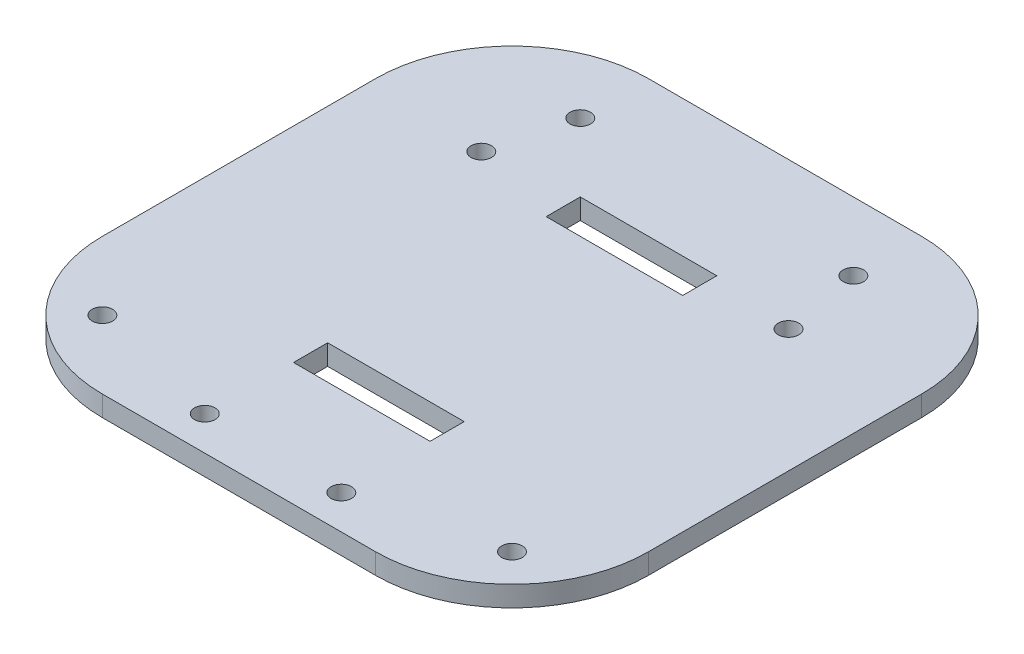
ISO-10303-21;
HEADER;
FILE_DESCRIPTION(('STEP AP214'),'2;1');
FILE_NAME('part.step','',(''),(''),'','','');
FILE_SCHEMA(('AUTOMOTIVE_DESIGN { 1 0 10303 214 1 1 1 1 }'));
ENDSEC;
DATA;
#1=APPLICATION_CONTEXT('core data for automotive mechanical design processes');
#2=APPLICATION_PROTOCOL_DEFINITION('international standard','automotive_design',2000,#1);
#3=PRODUCT_CONTEXT('',#1,'mechanical');
#4=PRODUCT('Part','Part','',(#3));
#5=PRODUCT_RELATED_PRODUCT_CATEGORY('part','',(#4));
#6=PRODUCT_DEFINITION_FORMATION('','',#4);
#7=PRODUCT_DEFINITION_CONTEXT('part definition',#1,'design');
#8=PRODUCT_DEFINITION('design','',#6,#7);
#9=PRODUCT_DEFINITION_SHAPE('','',#8);
#10=(LENGTH_UNIT() NAMED_UNIT(*) SI_UNIT(.MILLI.,.METRE.));
#11=(NAMED_UNIT(*) PLANE_ANGLE_UNIT() SI_UNIT($,.RADIAN.));
#12=(NAMED_UNIT(*) SI_UNIT($,.STERADIAN.) SOLID_ANGLE_UNIT());
#13=UNCERTAINTY_MEASURE_WITH_UNIT(LENGTH_MEASURE(1.E-05),#10,'distance_accuracy_value','');
#14=(GEOMETRIC_REPRESENTATION_CONTEXT(3) GLOBAL_UNCERTAINTY_ASSIGNED_CONTEXT((#13)) GLOBAL_UNIT_ASSIGNED_CONTEXT((#10,
#11,#12)) REPRESENTATION_CONTEXT('',''));
#15=CARTESIAN_POINT('',(0.,0.,0.));
#16=DIRECTION('',(0.,0.,1.));
#17=DIRECTION('',(1.,0.,0.));
#18=AXIS2_PLACEMENT_3D('',#15,#16,#17);
#19=CARTESIAN_POINT('',(20.,3.,-20.));
#20=DIRECTION('',(0.,-1.,0.));
#21=DIRECTION('',(0.,0.,-1.));
#22=AXIS2_PLACEMENT_3D('',#19,#20,#21);
#23=CYLINDRICAL_SURFACE('',#22,20.);
#24=DIRECTION('',(0.,-1.,0.));
#25=VECTOR('',#24,1.);
#26=CARTESIAN_POINT('',(20.,3.,0.));
#27=LINE('',#26,#25);
#28=CARTESIAN_POINT('',(20.,3.,0.));
#29=VERTEX_POINT('',#28);
#30=CARTESIAN_POINT('',(20.,0.,0.));
#31=VERTEX_POINT('',#30);
#32=EDGE_CURVE('E293',#29,#31,#27,.T.);
#33=ORIENTED_EDGE('',*,*,#32,.F.);
#34=CARTESIAN_POINT('',(20.,3.,-20.));
#35=DIRECTION('',(0.,-1.,0.));
#36=DIRECTION('',(0.,0.,-1.));
#37=AXIS2_PLACEMENT_3D('',#34,#35,#36);
#38=CIRCLE('',#37,20.);
#39=CARTESIAN_POINT('',(0.,3.,-20.));
#40=VERTEX_POINT('',#39);
#41=EDGE_CURVE('E299',#40,#29,#38,.F.);
#42=ORIENTED_EDGE('',*,*,#41,.F.);
#43=DIRECTION('',(0.,-1.,0.));
#44=VECTOR('',#43,1.);
#45=CARTESIAN_POINT('',(0.,3.,-20.));
#46=LINE('',#45,#44);
#47=CARTESIAN_POINT('',(0.,0.,-20.));
#48=VERTEX_POINT('',#47);
#49=EDGE_CURVE('E296',#48,#40,#46,.F.);
#50=ORIENTED_EDGE('',*,*,#49,.F.);
#51=CARTESIAN_POINT('',(20.,0.,-20.));
#52=DIRECTION('',(0.,-1.,0.));
#53=DIRECTION('',(0.,0.,-1.));
#54=AXIS2_PLACEMENT_3D('',#51,#52,#53);
#55=CIRCLE('',#54,20.);
#56=EDGE_CURVE('E301',#31,#48,#55,.T.);
#57=ORIENTED_EDGE('',*,*,#56,.F.);
#58=EDGE_LOOP('',(#33,#42,#50,#57));
#59=FACE_BOUND('',#58,.T.);
#60=ADVANCED_FACE('F35',(#59),#23,.T.);
#61=CARTESIAN_POINT('',(60.,3.,-20.));
#62=DIRECTION('',(0.,-1.,0.));
#63=DIRECTION('',(0.,0.,-1.));
#64=AXIS2_PLACEMENT_3D('',#61,#62,#63);
#65=CYLINDRICAL_SURFACE('',#64,20.);
#66=DIRECTION('',(0.,-1.,0.));
#67=VECTOR('',#66,1.);
#68=CARTESIAN_POINT('',(80.,3.,-20.));
#69=LINE('',#68,#67);
#70=CARTESIAN_POINT('',(80.,3.,-20.));
#71=VERTEX_POINT('',#70);
#72=CARTESIAN_POINT('',(80.,0.,-20.));
#73=VERTEX_POINT('',#72);
#74=EDGE_CURVE('E282',#71,#73,#69,.T.);
#75=ORIENTED_EDGE('',*,*,#74,.F.);
#76=CARTESIAN_POINT('',(60.,3.,-20.));
#77=DIRECTION('',(0.,-1.,0.));
#78=DIRECTION('',(0.,0.,-1.));
#79=AXIS2_PLACEMENT_3D('',#76,#77,#78);
#80=CIRCLE('',#79,20.);
#81=CARTESIAN_POINT('',(60.,3.,0.));
#82=VERTEX_POINT('',#81);
#83=EDGE_CURVE('E288',#82,#71,#80,.F.);
#84=ORIENTED_EDGE('',*,*,#83,.F.);
#85=DIRECTION('',(0.,-1.,0.));
#86=VECTOR('',#85,1.);
#87=CARTESIAN_POINT('',(60.,3.,0.));
#88=LINE('',#87,#86);
#89=CARTESIAN_POINT('',(60.,0.,0.));
#90=VERTEX_POINT('',#89);
#91=EDGE_CURVE('E285',#90,#82,#88,.F.);
#92=ORIENTED_EDGE('',*,*,#91,.F.);
#93=CARTESIAN_POINT('',(60.,0.,-20.));
#94=DIRECTION('',(0.,-1.,0.));
#95=DIRECTION('',(0.,0.,-1.));
#96=AXIS2_PLACEMENT_3D('',#93,#94,#95);
#97=CIRCLE('',#96,20.);
#98=EDGE_CURVE('E290',#73,#90,#97,.T.);
#99=ORIENTED_EDGE('',*,*,#98,.F.);
#100=EDGE_LOOP('',(#75,#84,#92,#99));
#101=FACE_BOUND('',#100,.T.);
#102=ADVANCED_FACE('F337',(#101),#65,.T.);
#103=CARTESIAN_POINT('',(60.,3.,-60.));
#104=DIRECTION('',(0.,1.,0.));
#105=DIRECTION('',(0.,0.,1.));
#106=AXIS2_PLACEMENT_3D('',#103,#104,#105);
#107=CYLINDRICAL_SURFACE('',#106,20.);
#108=DIRECTION('',(0.,1.,0.));
#109=VECTOR('',#108,1.);
#110=CARTESIAN_POINT('',(80.,3.,-60.));
#111=LINE('',#110,#109);
#112=CARTESIAN_POINT('',(80.,0.,-60.));
#113=VERTEX_POINT('',#112);
#114=CARTESIAN_POINT('',(80.,3.,-60.));
#115=VERTEX_POINT('',#114);
#116=EDGE_CURVE('E271',#113,#115,#111,.T.);
#117=ORIENTED_EDGE('',*,*,#116,.F.);
#118=CARTESIAN_POINT('',(60.,0.,-60.));
#119=DIRECTION('',(0.,-1.,0.));
#120=DIRECTION('',(0.,0.,-1.));
#121=AXIS2_PLACEMENT_3D('',#118,#119,#120);
#122=CIRCLE('',#121,20.);
#123=CARTESIAN_POINT('',(60.,0.,-80.));
#124=VERTEX_POINT('',#123);
#125=EDGE_CURVE('E277',#124,#113,#122,.T.);
#126=ORIENTED_EDGE('',*,*,#125,.F.);
#127=DIRECTION('',(0.,1.,0.));
#128=VECTOR('',#127,1.);
#129=CARTESIAN_POINT('',(60.,3.,-80.));
#130=LINE('',#129,#128);
#131=CARTESIAN_POINT('',(60.,3.,-80.));
#132=VERTEX_POINT('',#131);
#133=EDGE_CURVE('E274',#132,#124,#130,.F.);
#134=ORIENTED_EDGE('',*,*,#133,.F.);
#135=CARTESIAN_POINT('',(60.,3.,-60.));
#136=DIRECTION('',(0.,-1.,0.));
#137=DIRECTION('',(0.,0.,-1.));
#138=AXIS2_PLACEMENT_3D('',#135,#136,#137);
#139=CIRCLE('',#138,20.);
#140=EDGE_CURVE('E280',#115,#132,#139,.F.);
#141=ORIENTED_EDGE('',*,*,#140,.F.);
#142=EDGE_LOOP('',(#117,#126,#134,#141));
#143=FACE_BOUND('',#142,.T.);
#144=ADVANCED_FACE('F342',(#143),#107,.T.);
#145=CARTESIAN_POINT('',(20.,3.,-60.));
#146=DIRECTION('',(0.,-1.,0.));
#147=DIRECTION('',(0.,0.,-1.));
#148=AXIS2_PLACEMENT_3D('',#145,#146,#147);
#149=CYLINDRICAL_SURFACE('',#148,20.);
#150=DIRECTION('',(0.,-1.,0.));
#151=VECTOR('',#150,1.);
#152=CARTESIAN_POINT('',(0.,3.,-60.));
#153=LINE('',#152,#151);
#154=CARTESIAN_POINT('',(0.,3.,-60.));
#155=VERTEX_POINT('',#154);
#156=CARTESIAN_POINT('',(0.,0.,-60.));
#157=VERTEX_POINT('',#156);
#158=EDGE_CURVE('E253',#155,#157,#153,.T.);
#159=ORIENTED_EDGE('',*,*,#158,.F.);
#160=CARTESIAN_POINT('',(20.,3.,-60.));
#161=DIRECTION('',(0.,-1.,0.));
#162=DIRECTION('',(0.,0.,-1.));
#163=AXIS2_PLACEMENT_3D('',#160,#161,#162);
#164=CIRCLE('',#163,20.);
#165=CARTESIAN_POINT('',(20.,3.,-80.));
#166=VERTEX_POINT('',#165);
#167=EDGE_CURVE('E266',#166,#155,#164,.F.);
#168=ORIENTED_EDGE('',*,*,#167,.F.);
#169=DIRECTION('',(0.,-1.,0.));
#170=VECTOR('',#169,1.);
#171=CARTESIAN_POINT('',(20.,3.,-80.));
#172=LINE('',#171,#170);
#173=CARTESIAN_POINT('',(20.,0.,-80.));
#174=VERTEX_POINT('',#173);
#175=EDGE_CURVE('E263',#174,#166,#172,.F.);
#176=ORIENTED_EDGE('',*,*,#175,.F.);
#177=CARTESIAN_POINT('',(20.,0.,-60.));
#178=DIRECTION('',(0.,-1.,0.));
#179=DIRECTION('',(0.,0.,-1.));
#180=AXIS2_PLACEMENT_3D('',#177,#178,#179);
#181=CIRCLE('',#180,20.);
#182=EDGE_CURVE('E268',#157,#174,#181,.T.);
#183=ORIENTED_EDGE('',*,*,#182,.F.);
#184=EDGE_LOOP('',(#159,#168,#176,#183));
#185=FACE_BOUND('',#184,.T.);
#186=ADVANCED_FACE('F370',(#185),#149,.T.);
#187=CARTESIAN_POINT('',(0.,3.,0.));
#188=DIRECTION('',(1.,0.,0.));
#189=DIRECTION('',(0.,0.,-1.));
#190=AXIS2_PLACEMENT_3D('',#187,#188,#189);
#191=PLANE('',#190);
#192=DIRECTION('',(0.,0.,1.));
#193=VECTOR('',#192,1.);
#194=CARTESIAN_POINT('',(0.,0.,0.));
#195=LINE('',#194,#193);
#196=EDGE_CURVE('E240',#157,#48,#195,.T.);
#197=ORIENTED_EDGE('',*,*,#196,.T.);
#198=ORIENTED_EDGE('',*,*,#49,.T.);
#199=DIRECTION('',(0.,0.,1.));
#200=VECTOR('',#199,1.);
#201=CARTESIAN_POINT('',(0.,3.,0.));
#202=LINE('',#201,#200);
#203=EDGE_CURVE('E243',#155,#40,#202,.T.);
#204=ORIENTED_EDGE('',*,*,#203,.F.);
#205=ORIENTED_EDGE('',*,*,#158,.T.);
#206=EDGE_LOOP('',(#197,#198,#204,#205));
#207=FACE_BOUND('',#206,.T.);
#208=ADVANCED_FACE('F374',(#207),#191,.F.);
#209=CARTESIAN_POINT('',(0.,3.,0.));
#210=DIRECTION('',(0.,0.,-1.));
#211=DIRECTION('',(-1.,0.,0.));
#212=AXIS2_PLACEMENT_3D('',#209,#210,#211);
#213=PLANE('',#212);
#214=DIRECTION('',(1.,0.,0.));
#215=VECTOR('',#214,1.);
#216=CARTESIAN_POINT('',(0.,3.,0.));
#217=LINE('',#216,#215);
#218=EDGE_CURVE('E246',#29,#82,#217,.T.);
#219=ORIENTED_EDGE('',*,*,#218,.F.);
#220=ORIENTED_EDGE('',*,*,#32,.T.);
#221=DIRECTION('',(1.,0.,0.));
#222=VECTOR('',#221,1.);
#223=CARTESIAN_POINT('',(0.,0.,0.));
#224=LINE('',#223,#222);
#225=EDGE_CURVE('E256',#31,#90,#224,.T.);
#226=ORIENTED_EDGE('',*,*,#225,.T.);
#227=ORIENTED_EDGE('',*,*,#91,.T.);
#228=EDGE_LOOP('',(#219,#220,#226,#227));
#229=FACE_BOUND('',#228,.T.);
#230=ADVANCED_FACE('F349',(#229),#213,.F.);
#231=CARTESIAN_POINT('',(80.,3.,0.));
#232=DIRECTION('',(-1.,0.,0.));
#233=DIRECTION('',(0.,0.,1.));
#234=AXIS2_PLACEMENT_3D('',#231,#232,#233);
#235=PLANE('',#234);
#236=DIRECTION('',(0.,0.,-1.));
#237=VECTOR('',#236,1.);
#238=CARTESIAN_POINT('',(80.,3.,0.));
#239=LINE('',#238,#237);
#240=EDGE_CURVE('E249',#71,#115,#239,.T.);
#241=ORIENTED_EDGE('',*,*,#240,.F.);
#242=ORIENTED_EDGE('',*,*,#74,.T.);
#243=DIRECTION('',(0.,0.,-1.));
#244=VECTOR('',#243,1.);
#245=CARTESIAN_POINT('',(80.,0.,0.));
#246=LINE('',#245,#244);
#247=EDGE_CURVE('E258',#73,#113,#246,.T.);
#248=ORIENTED_EDGE('',*,*,#247,.T.);
#249=ORIENTED_EDGE('',*,*,#116,.T.);
#250=EDGE_LOOP('',(#241,#242,#248,#249));
#251=FACE_BOUND('',#250,.T.);
#252=ADVANCED_FACE('F357',(#251),#235,.F.);
#253=CARTESIAN_POINT('',(0.,3.,-80.));
#254=DIRECTION('',(0.,0.,1.));
#255=DIRECTION('',(1.,0.,0.));
#256=AXIS2_PLACEMENT_3D('',#253,#254,#255);
#257=PLANE('',#256);
#258=DIRECTION('',(-1.,0.,0.));
#259=VECTOR('',#258,1.);
#260=CARTESIAN_POINT('',(0.,3.,-80.));
#261=LINE('',#260,#259);
#262=EDGE_CURVE('E251',#132,#166,#261,.T.);
#263=ORIENTED_EDGE('',*,*,#262,.F.);
#264=ORIENTED_EDGE('',*,*,#133,.T.);
#265=DIRECTION('',(-1.,0.,0.));
#266=VECTOR('',#265,1.);
#267=CARTESIAN_POINT('',(0.,0.,-80.));
#268=LINE('',#267,#266);
#269=EDGE_CURVE('E247',#124,#174,#268,.T.);
#270=ORIENTED_EDGE('',*,*,#269,.T.);
#271=ORIENTED_EDGE('',*,*,#175,.T.);
#272=EDGE_LOOP('',(#263,#264,#270,#271));
#273=FACE_BOUND('',#272,.T.);
#274=ADVANCED_FACE('F365',(#273),#257,.F.);
#275=CARTESIAN_POINT('',(0.,3.,0.));
#276=DIRECTION('',(0.,-1.,0.));
#277=DIRECTION('',(0.,0.,-1.));
#278=AXIS2_PLACEMENT_3D('',#275,#276,#277);
#279=PLANE('',#278);
#280=DIRECTION('',(1.,0.,0.));
#281=VECTOR('',#280,1.);
#282=CARTESIAN_POINT('',(30.,3.,-18.));
#283=LINE('',#282,#281);
#284=CARTESIAN_POINT('',(30.,3.,-18.));
#285=VERTEX_POINT('',#284);
#286=CARTESIAN_POINT('',(50.,3.,-18.));
#287=VERTEX_POINT('',#286);
#288=EDGE_CURVE('E158',#285,#287,#283,.T.);
#289=ORIENTED_EDGE('',*,*,#288,.F.);
#290=DIRECTION('',(0.,0.,1.));
#291=VECTOR('',#290,1.);
#292=CARTESIAN_POINT('',(30.,3.,-23.));
#293=LINE('',#292,#291);
#294=CARTESIAN_POINT('',(30.,3.,-23.));
#295=VERTEX_POINT('',#294);
#296=EDGE_CURVE('E49',#295,#285,#293,.T.);
#297=ORIENTED_EDGE('',*,*,#296,.F.);
#298=DIRECTION('',(-1.,0.,0.));
#299=VECTOR('',#298,1.);
#300=CARTESIAN_POINT('',(30.,3.,-23.));
#301=LINE('',#300,#299);
#302=CARTESIAN_POINT('',(50.,3.,-23.));
#303=VERTEX_POINT('',#302);
#304=EDGE_CURVE('E165',#303,#295,#301,.T.);
#305=ORIENTED_EDGE('',*,*,#304,.F.);
#306=DIRECTION('',(0.,0.,-1.));
#307=VECTOR('',#306,1.);
#308=CARTESIAN_POINT('',(50.,3.,-23.));
#309=LINE('',#308,#307);
#310=EDGE_CURVE('E149',#287,#303,#309,.T.);
#311=ORIENTED_EDGE('',*,*,#310,.F.);
#312=EDGE_LOOP('',(#289,#297,#305,#311));
#313=FACE_BOUND('',#312,.T.);
#314=DIRECTION('',(1.,0.,0.));
#315=VECTOR('',#314,1.);
#316=CARTESIAN_POINT('',(30.,3.,-55.));
#317=LINE('',#316,#315);
#318=CARTESIAN_POINT('',(30.,3.,-55.));
#319=VERTEX_POINT('',#318);
#320=CARTESIAN_POINT('',(50.,3.,-55.));
#321=VERTEX_POINT('',#320);
#322=EDGE_CURVE('E176',#319,#321,#317,.T.);
#323=ORIENTED_EDGE('',*,*,#322,.F.);
#324=DIRECTION('',(0.,0.,1.));
#325=VECTOR('',#324,1.);
#326=CARTESIAN_POINT('',(30.,3.,-60.));
#327=LINE('',#326,#325);
#328=CARTESIAN_POINT('',(30.,3.,-60.));
#329=VERTEX_POINT('',#328);
#330=EDGE_CURVE('E172',#329,#319,#327,.T.);
#331=ORIENTED_EDGE('',*,*,#330,.F.);
#332=DIRECTION('',(-1.,0.,0.));
#333=VECTOR('',#332,1.);
#334=CARTESIAN_POINT('',(30.,3.,-60.));
#335=LINE('',#334,#333);
#336=CARTESIAN_POINT('',(50.,3.,-60.));
#337=VERTEX_POINT('',#336);
#338=EDGE_CURVE('E182',#337,#329,#335,.T.);
#339=ORIENTED_EDGE('',*,*,#338,.F.);
#340=DIRECTION('',(0.,0.,-1.));
#341=VECTOR('',#340,1.);
#342=CARTESIAN_POINT('',(50.,3.,-60.));
#343=LINE('',#342,#341);
#344=EDGE_CURVE('E179',#321,#337,#343,.T.);
#345=ORIENTED_EDGE('',*,*,#344,.F.);
#346=EDGE_LOOP('',(#323,#331,#339,#345));
#347=FACE_BOUND('',#346,.T.);
#348=CARTESIAN_POINT('',(60.,3.,-70.));
#349=DIRECTION('',(0.,1.,0.));
#350=DIRECTION('',(0.,0.,1.));
#351=AXIS2_PLACEMENT_3D('',#348,#349,#350);
#352=CIRCLE('',#351,1.5);
#353=CARTESIAN_POINT('',(60.,3.,-68.5));
#354=VERTEX_POINT('',#353);
#355=EDGE_CURVE('E188',#354,#354,#352,.T.);
#356=ORIENTED_EDGE('',*,*,#355,.F.);
#357=EDGE_LOOP('',(#356));
#358=FACE_BOUND('',#357,.T.);
#359=CARTESIAN_POINT('',(20.,3.,-70.));
#360=DIRECTION('',(0.,1.,0.));
#361=DIRECTION('',(0.,0.,1.));
#362=AXIS2_PLACEMENT_3D('',#359,#360,#361);
#363=CIRCLE('',#362,1.5);
#364=CARTESIAN_POINT('',(20.,3.,-68.5));
#365=VERTEX_POINT('',#364);
#366=EDGE_CURVE('E198',#365,#365,#363,.T.);
#367=ORIENTED_EDGE('',*,*,#366,.F.);
#368=EDGE_LOOP('',(#367));
#369=FACE_BOUND('',#368,.T.);
#370=CARTESIAN_POINT('',(50.,3.,-5.));
#371=DIRECTION('',(0.,1.,0.));
#372=DIRECTION('',(0.,0.,1.));
#373=AXIS2_PLACEMENT_3D('',#370,#371,#372);
#374=CIRCLE('',#373,1.5);
#375=CARTESIAN_POINT('',(50.,3.,-3.5));
#376=VERTEX_POINT('',#375);
#377=EDGE_CURVE('E204',#376,#376,#374,.T.);
#378=ORIENTED_EDGE('',*,*,#377,.F.);
#379=EDGE_LOOP('',(#378));
#380=FACE_BOUND('',#379,.T.);
#381=CARTESIAN_POINT('',(30.,3.,-5.));
#382=DIRECTION('',(0.,1.,0.));
#383=DIRECTION('',(0.,0.,1.));
#384=AXIS2_PLACEMENT_3D('',#381,#382,#383);
#385=CIRCLE('',#384,1.5);
#386=CARTESIAN_POINT('',(30.,3.,-3.49999999999999));
#387=VERTEX_POINT('',#386);
#388=EDGE_CURVE('E210',#387,#387,#385,.T.);
#389=ORIENTED_EDGE('',*,*,#388,.F.);
#390=EDGE_LOOP('',(#389));
#391=FACE_BOUND('',#390,.T.);
#392=CARTESIAN_POINT('',(10.,3.,-10.));
#393=DIRECTION('',(0.,1.,0.));
#394=DIRECTION('',(0.,0.,1.));
#395=AXIS2_PLACEMENT_3D('',#392,#393,#394);
#396=CIRCLE('',#395,1.5);
#397=CARTESIAN_POINT('',(10.,3.,-8.49999999999999));
#398=VERTEX_POINT('',#397);
#399=EDGE_CURVE('E216',#398,#398,#396,.T.);
#400=ORIENTED_EDGE('',*,*,#399,.F.);
#401=EDGE_LOOP('',(#400));
#402=FACE_BOUND('',#401,.T.);
#403=CARTESIAN_POINT('',(70.,3.,-9.99999999999999));
#404=DIRECTION('',(0.,1.,0.));
#405=DIRECTION('',(0.,0.,1.));
#406=AXIS2_PLACEMENT_3D('',#403,#404,#405);
#407=CIRCLE('',#406,1.5);
#408=CARTESIAN_POINT('',(70.,3.,-8.5));
#409=VERTEX_POINT('',#408);
#410=EDGE_CURVE('E222',#409,#409,#407,.T.);
#411=ORIENTED_EDGE('',*,*,#410,.F.);
#412=EDGE_LOOP('',(#411));
#413=FACE_BOUND('',#412,.T.);
#414=CARTESIAN_POINT('',(62.,3.,-58.5));
#415=DIRECTION('',(0.,1.,0.));
#416=DIRECTION('',(0.,0.,1.));
#417=AXIS2_PLACEMENT_3D('',#414,#415,#416);
#418=CIRCLE('',#417,1.5);
#419=CARTESIAN_POINT('',(62.,3.,-57.));
#420=VERTEX_POINT('',#419);
#421=EDGE_CURVE('E228',#420,#420,#418,.T.);
#422=ORIENTED_EDGE('',*,*,#421,.F.);
#423=EDGE_LOOP('',(#422));
#424=FACE_BOUND('',#423,.T.);
#425=CARTESIAN_POINT('',(17.,3.,-58.5));
#426=DIRECTION('',(0.,1.,0.));
#427=DIRECTION('',(0.,0.,1.));
#428=AXIS2_PLACEMENT_3D('',#425,#426,#427);
#429=CIRCLE('',#428,1.5);
#430=CARTESIAN_POINT('',(17.,3.,-57.));
#431=VERTEX_POINT('',#430);
#432=EDGE_CURVE('E234',#431,#431,#429,.T.);
#433=ORIENTED_EDGE('',*,*,#432,.F.);
#434=EDGE_LOOP('',(#433));
#435=FACE_BOUND('',#434,.T.);
#436=ORIENTED_EDGE('',*,*,#203,.T.);
#437=ORIENTED_EDGE('',*,*,#41,.T.);
#438=ORIENTED_EDGE('',*,*,#218,.T.);
#439=ORIENTED_EDGE('',*,*,#83,.T.);
#440=ORIENTED_EDGE('',*,*,#240,.T.);
#441=ORIENTED_EDGE('',*,*,#140,.T.);
#442=ORIENTED_EDGE('',*,*,#262,.T.);
#443=ORIENTED_EDGE('',*,*,#167,.T.);
#444=EDGE_LOOP('',(#436,#437,#438,#439,#440,#441,#442,#443));
#445=FACE_BOUND('',#444,.T.);
#446=ADVANCED_FACE('F162',(#313,#347,#358,#369,#380,#391,#402,#413,#424,#435,#445),#279,.F.);
#447=CARTESIAN_POINT('',(0.,0.,0.));
#448=DIRECTION('',(0.,-1.,0.));
#449=DIRECTION('',(0.,0.,-1.));
#450=AXIS2_PLACEMENT_3D('',#447,#448,#449);
#451=PLANE('',#450);
#452=DIRECTION('',(0.,0.,-1.));
#453=VECTOR('',#452,1.);
#454=CARTESIAN_POINT('',(30.,0.,0.));
#455=LINE('',#454,#453);
#456=CARTESIAN_POINT('',(30.,0.,-18.));
#457=VERTEX_POINT('',#456);
#458=CARTESIAN_POINT('',(30.,0.,-23.));
#459=VERTEX_POINT('',#458);
#460=EDGE_CURVE('E11',#457,#459,#455,.T.);
#461=ORIENTED_EDGE('',*,*,#460,.F.);
#462=DIRECTION('',(-1.,0.,0.));
#463=VECTOR('',#462,1.);
#464=CARTESIAN_POINT('',(0.,0.,-18.));
#465=LINE('',#464,#463);
#466=CARTESIAN_POINT('',(50.,0.,-18.));
#467=VERTEX_POINT('',#466);
#468=EDGE_CURVE('E312',#467,#457,#465,.T.);
#469=ORIENTED_EDGE('',*,*,#468,.F.);
#470=DIRECTION('',(0.,0.,1.));
#471=VECTOR('',#470,1.);
#472=CARTESIAN_POINT('',(50.,0.,0.));
#473=LINE('',#472,#471);
#474=CARTESIAN_POINT('',(50.,0.,-23.));
#475=VERTEX_POINT('',#474);
#476=EDGE_CURVE('E152',#475,#467,#473,.T.);
#477=ORIENTED_EDGE('',*,*,#476,.F.);
#478=DIRECTION('',(1.,0.,0.));
#479=VECTOR('',#478,1.);
#480=CARTESIAN_POINT('',(0.,0.,-23.));
#481=LINE('',#480,#479);
#482=EDGE_CURVE('E42',#459,#475,#481,.T.);
#483=ORIENTED_EDGE('',*,*,#482,.F.);
#484=EDGE_LOOP('',(#461,#469,#477,#483));
#485=FACE_BOUND('',#484,.T.);
#486=DIRECTION('',(0.,0.,-1.));
#487=VECTOR('',#486,1.);
#488=CARTESIAN_POINT('',(30.,0.,0.));
#489=LINE('',#488,#487);
#490=CARTESIAN_POINT('',(30.,0.,-55.));
#491=VERTEX_POINT('',#490);
#492=CARTESIAN_POINT('',(30.,0.,-60.));
#493=VERTEX_POINT('',#492);
#494=EDGE_CURVE('E310',#491,#493,#489,.T.);
#495=ORIENTED_EDGE('',*,*,#494,.F.);
#496=DIRECTION('',(-1.,0.,0.));
#497=VECTOR('',#496,1.);
#498=CARTESIAN_POINT('',(0.,0.,-55.));
#499=LINE('',#498,#497);
#500=CARTESIAN_POINT('',(50.,0.,-55.));
#501=VERTEX_POINT('',#500);
#502=EDGE_CURVE('E303',#501,#491,#499,.T.);
#503=ORIENTED_EDGE('',*,*,#502,.F.);
#504=DIRECTION('',(0.,0.,1.));
#505=VECTOR('',#504,1.);
#506=CARTESIAN_POINT('',(50.,0.,0.));
#507=LINE('',#506,#505);
#508=CARTESIAN_POINT('',(50.,0.,-60.));
#509=VERTEX_POINT('',#508);
#510=EDGE_CURVE('E305',#509,#501,#507,.T.);
#511=ORIENTED_EDGE('',*,*,#510,.F.);
#512=DIRECTION('',(1.,0.,0.));
#513=VECTOR('',#512,1.);
#514=CARTESIAN_POINT('',(0.,0.,-60.));
#515=LINE('',#514,#513);
#516=EDGE_CURVE('E308',#493,#509,#515,.T.);
#517=ORIENTED_EDGE('',*,*,#516,.F.);
#518=EDGE_LOOP('',(#495,#503,#511,#517));
#519=FACE_BOUND('',#518,.T.);
#520=CARTESIAN_POINT('',(60.,0.,-70.));
#521=DIRECTION('',(0.,1.,0.));
#522=DIRECTION('',(0.,0.,1.));
#523=AXIS2_PLACEMENT_3D('',#520,#521,#522);
#524=CIRCLE('',#523,1.5);
#525=CARTESIAN_POINT('',(60.,0.,-68.5));
#526=VERTEX_POINT('',#525);
#527=EDGE_CURVE('E195',#526,#526,#524,.T.);
#528=ORIENTED_EDGE('',*,*,#527,.T.);
#529=EDGE_LOOP('',(#528));
#530=FACE_BOUND('',#529,.T.);
#531=CARTESIAN_POINT('',(20.,0.,-70.));
#532=DIRECTION('',(0.,1.,0.));
#533=DIRECTION('',(0.,0.,1.));
#534=AXIS2_PLACEMENT_3D('',#531,#532,#533);
#535=CIRCLE('',#534,1.5);
#536=CARTESIAN_POINT('',(20.,0.,-68.5));
#537=VERTEX_POINT('',#536);
#538=EDGE_CURVE('E201',#537,#537,#535,.T.);
#539=ORIENTED_EDGE('',*,*,#538,.T.);
#540=EDGE_LOOP('',(#539));
#541=FACE_BOUND('',#540,.T.);
#542=CARTESIAN_POINT('',(50.,0.,-5.));
#543=DIRECTION('',(0.,1.,0.));
#544=DIRECTION('',(0.,0.,1.));
#545=AXIS2_PLACEMENT_3D('',#542,#543,#544);
#546=CIRCLE('',#545,1.5);
#547=CARTESIAN_POINT('',(50.,0.,-3.5));
#548=VERTEX_POINT('',#547);
#549=EDGE_CURVE('E207',#548,#548,#546,.T.);
#550=ORIENTED_EDGE('',*,*,#549,.T.);
#551=EDGE_LOOP('',(#550));
#552=FACE_BOUND('',#551,.T.);
#553=CARTESIAN_POINT('',(30.,0.,-5.));
#554=DIRECTION('',(0.,1.,0.));
#555=DIRECTION('',(0.,0.,1.));
#556=AXIS2_PLACEMENT_3D('',#553,#554,#555);
#557=CIRCLE('',#556,1.5);
#558=CARTESIAN_POINT('',(30.,0.,-3.49999999999999));
#559=VERTEX_POINT('',#558);
#560=EDGE_CURVE('E213',#559,#559,#557,.T.);
#561=ORIENTED_EDGE('',*,*,#560,.T.);
#562=EDGE_LOOP('',(#561));
#563=FACE_BOUND('',#562,.T.);
#564=CARTESIAN_POINT('',(10.,0.,-10.));
#565=DIRECTION('',(0.,1.,0.));
#566=DIRECTION('',(0.,0.,1.));
#567=AXIS2_PLACEMENT_3D('',#564,#565,#566);
#568=CIRCLE('',#567,1.5);
#569=CARTESIAN_POINT('',(10.,0.,-8.49999999999999));
#570=VERTEX_POINT('',#569);
#571=EDGE_CURVE('E219',#570,#570,#568,.T.);
#572=ORIENTED_EDGE('',*,*,#571,.T.);
#573=EDGE_LOOP('',(#572));
#574=FACE_BOUND('',#573,.T.);
#575=CARTESIAN_POINT('',(70.,0.,-9.99999999999999));
#576=DIRECTION('',(0.,1.,0.));
#577=DIRECTION('',(0.,0.,1.));
#578=AXIS2_PLACEMENT_3D('',#575,#576,#577);
#579=CIRCLE('',#578,1.5);
#580=CARTESIAN_POINT('',(70.,0.,-8.5));
#581=VERTEX_POINT('',#580);
#582=EDGE_CURVE('E225',#581,#581,#579,.T.);
#583=ORIENTED_EDGE('',*,*,#582,.T.);
#584=EDGE_LOOP('',(#583));
#585=FACE_BOUND('',#584,.T.);
#586=CARTESIAN_POINT('',(62.,0.,-58.5));
#587=DIRECTION('',(0.,1.,0.));
#588=DIRECTION('',(0.,0.,1.));
#589=AXIS2_PLACEMENT_3D('',#586,#587,#588);
#590=CIRCLE('',#589,1.5);
#591=CARTESIAN_POINT('',(62.,0.,-57.));
#592=VERTEX_POINT('',#591);
#593=EDGE_CURVE('E231',#592,#592,#590,.T.);
#594=ORIENTED_EDGE('',*,*,#593,.T.);
#595=EDGE_LOOP('',(#594));
#596=FACE_BOUND('',#595,.T.);
#597=CARTESIAN_POINT('',(17.,0.,-58.5));
#598=DIRECTION('',(0.,1.,0.));
#599=DIRECTION('',(0.,0.,1.));
#600=AXIS2_PLACEMENT_3D('',#597,#598,#599);
#601=CIRCLE('',#600,1.5);
#602=CARTESIAN_POINT('',(17.,0.,-57.));
#603=VERTEX_POINT('',#602);
#604=EDGE_CURVE('E237',#603,#603,#601,.T.);
#605=ORIENTED_EDGE('',*,*,#604,.T.);
#606=EDGE_LOOP('',(#605));
#607=FACE_BOUND('',#606,.T.);
#608=ORIENTED_EDGE('',*,*,#225,.F.);
#609=ORIENTED_EDGE('',*,*,#56,.T.);
#610=ORIENTED_EDGE('',*,*,#196,.F.);
#611=ORIENTED_EDGE('',*,*,#182,.T.);
#612=ORIENTED_EDGE('',*,*,#269,.F.);
#613=ORIENTED_EDGE('',*,*,#125,.T.);
#614=ORIENTED_EDGE('',*,*,#247,.F.);
#615=ORIENTED_EDGE('',*,*,#98,.T.);
#616=EDGE_LOOP('',(#608,#609,#610,#611,#612,#613,#614,#615));
#617=FACE_BOUND('',#616,.T.);
#618=ADVANCED_FACE('F320',(#485,#519,#530,#541,#552,#563,#574,#585,#596,#607,#617),#451,.T.);
#619=CARTESIAN_POINT('',(17.,0.,-58.5));
#620=DIRECTION('',(0.,1.,0.));
#621=DIRECTION('',(0.,0.,1.));
#622=AXIS2_PLACEMENT_3D('',#619,#620,#621);
#623=CYLINDRICAL_SURFACE('',#622,1.5);
#624=ORIENTED_EDGE('',*,*,#604,.F.);
#625=EDGE_LOOP('',(#624));
#626=FACE_BOUND('',#625,.T.);
#627=ORIENTED_EDGE('',*,*,#432,.T.);
#628=EDGE_LOOP('',(#627));
#629=FACE_BOUND('',#628,.T.);
#630=ADVANCED_FACE('F377',(#626,#629),#623,.F.);
#631=CARTESIAN_POINT('',(62.,0.,-58.5));
#632=DIRECTION('',(0.,1.,0.));
#633=DIRECTION('',(0.,0.,1.));
#634=AXIS2_PLACEMENT_3D('',#631,#632,#633);
#635=CYLINDRICAL_SURFACE('',#634,1.5);
#636=ORIENTED_EDGE('',*,*,#593,.F.);
#637=EDGE_LOOP('',(#636));
#638=FACE_BOUND('',#637,.T.);
#639=ORIENTED_EDGE('',*,*,#421,.T.);
#640=EDGE_LOOP('',(#639));
#641=FACE_BOUND('',#640,.T.);
#642=ADVANCED_FACE('F384',(#638,#641),#635,.F.);
#643=CARTESIAN_POINT('',(70.,0.,-9.99999999999999));
#644=DIRECTION('',(0.,1.,0.));
#645=DIRECTION('',(0.,0.,1.));
#646=AXIS2_PLACEMENT_3D('',#643,#644,#645);
#647=CYLINDRICAL_SURFACE('',#646,1.5);
#648=ORIENTED_EDGE('',*,*,#582,.F.);
#649=EDGE_LOOP('',(#648));
#650=FACE_BOUND('',#649,.T.);
#651=ORIENTED_EDGE('',*,*,#410,.T.);
#652=EDGE_LOOP('',(#651));
#653=FACE_BOUND('',#652,.T.);
#654=ADVANCED_FACE('F445',(#650,#653),#647,.F.);
#655=CARTESIAN_POINT('',(10.,0.,-10.));
#656=DIRECTION('',(0.,1.,0.));
#657=DIRECTION('',(0.,0.,1.));
#658=AXIS2_PLACEMENT_3D('',#655,#656,#657);
#659=CYLINDRICAL_SURFACE('',#658,1.5);
#660=ORIENTED_EDGE('',*,*,#571,.F.);
#661=EDGE_LOOP('',(#660));
#662=FACE_BOUND('',#661,.T.);
#663=ORIENTED_EDGE('',*,*,#399,.T.);
#664=EDGE_LOOP('',(#663));
#665=FACE_BOUND('',#664,.T.);
#666=ADVANCED_FACE('F453',(#662,#665),#659,.F.);
#667=CARTESIAN_POINT('',(30.,0.,-5.));
#668=DIRECTION('',(0.,1.,0.));
#669=DIRECTION('',(0.,0.,1.));
#670=AXIS2_PLACEMENT_3D('',#667,#668,#669);
#671=CYLINDRICAL_SURFACE('',#670,1.5);
#672=ORIENTED_EDGE('',*,*,#560,.F.);
#673=EDGE_LOOP('',(#672));
#674=FACE_BOUND('',#673,.T.);
#675=ORIENTED_EDGE('',*,*,#388,.T.);
#676=EDGE_LOOP('',(#675));
#677=FACE_BOUND('',#676,.T.);
#678=ADVANCED_FACE('F461',(#674,#677),#671,.F.);
#679=CARTESIAN_POINT('',(50.,0.,-5.));
#680=DIRECTION('',(0.,1.,0.));
#681=DIRECTION('',(0.,0.,1.));
#682=AXIS2_PLACEMENT_3D('',#679,#680,#681);
#683=CYLINDRICAL_SURFACE('',#682,1.5);
#684=ORIENTED_EDGE('',*,*,#549,.F.);
#685=EDGE_LOOP('',(#684));
#686=FACE_BOUND('',#685,.T.);
#687=ORIENTED_EDGE('',*,*,#377,.T.);
#688=EDGE_LOOP('',(#687));
#689=FACE_BOUND('',#688,.T.);
#690=ADVANCED_FACE('F469',(#686,#689),#683,.F.);
#691=CARTESIAN_POINT('',(20.,0.,-70.));
#692=DIRECTION('',(0.,1.,0.));
#693=DIRECTION('',(0.,0.,1.));
#694=AXIS2_PLACEMENT_3D('',#691,#692,#693);
#695=CYLINDRICAL_SURFACE('',#694,1.5);
#696=ORIENTED_EDGE('',*,*,#538,.F.);
#697=EDGE_LOOP('',(#696));
#698=FACE_BOUND('',#697,.T.);
#699=ORIENTED_EDGE('',*,*,#366,.T.);
#700=EDGE_LOOP('',(#699));
#701=FACE_BOUND('',#700,.T.);
#702=ADVANCED_FACE('F477',(#698,#701),#695,.F.);
#703=CARTESIAN_POINT('',(60.,0.,-70.));
#704=DIRECTION('',(0.,1.,0.));
#705=DIRECTION('',(0.,0.,1.));
#706=AXIS2_PLACEMENT_3D('',#703,#704,#705);
#707=CYLINDRICAL_SURFACE('',#706,1.5);
#708=ORIENTED_EDGE('',*,*,#527,.F.);
#709=EDGE_LOOP('',(#708));
#710=FACE_BOUND('',#709,.T.);
#711=ORIENTED_EDGE('',*,*,#355,.T.);
#712=EDGE_LOOP('',(#711));
#713=FACE_BOUND('',#712,.T.);
#714=ADVANCED_FACE('F485',(#710,#713),#707,.F.);
#715=CARTESIAN_POINT('',(30.,-7.,-60.));
#716=DIRECTION('',(-1.,0.,0.));
#717=DIRECTION('',(0.,0.,1.));
#718=AXIS2_PLACEMENT_3D('',#715,#716,#717);
#719=PLANE('',#718);
#720=ORIENTED_EDGE('',*,*,#494,.T.);
#721=DIRECTION('',(0.,1.,0.));
#722=VECTOR('',#721,1.);
#723=CARTESIAN_POINT('',(30.,-7.,-60.));
#724=LINE('',#723,#722);
#725=EDGE_CURVE('E186',#493,#329,#724,.T.);
#726=ORIENTED_EDGE('',*,*,#725,.T.);
#727=ORIENTED_EDGE('',*,*,#330,.T.);
#728=DIRECTION('',(0.,1.,0.));
#729=VECTOR('',#728,1.);
#730=CARTESIAN_POINT('',(30.,-7.,-55.));
#731=LINE('',#730,#729);
#732=EDGE_CURVE('E185',#491,#319,#731,.T.);
#733=ORIENTED_EDGE('',*,*,#732,.F.);
#734=EDGE_LOOP('',(#720,#726,#727,#733));
#735=FACE_BOUND('',#734,.T.);
#736=ADVANCED_FACE('F492',(#735),#719,.F.);
#737=CARTESIAN_POINT('',(30.,-7.,-60.));
#738=DIRECTION('',(0.,0.,-1.));
#739=DIRECTION('',(-1.,0.,0.));
#740=AXIS2_PLACEMENT_3D('',#737,#738,#739);
#741=PLANE('',#740);
#742=ORIENTED_EDGE('',*,*,#516,.T.);
#743=DIRECTION('',(0.,1.,0.));
#744=VECTOR('',#743,1.);
#745=CARTESIAN_POINT('',(50.,-7.,-60.));
#746=LINE('',#745,#744);
#747=EDGE_CURVE('E189',#509,#337,#746,.T.);
#748=ORIENTED_EDGE('',*,*,#747,.T.);
#749=ORIENTED_EDGE('',*,*,#338,.T.);
#750=ORIENTED_EDGE('',*,*,#725,.F.);
#751=EDGE_LOOP('',(#742,#748,#749,#750));
#752=FACE_BOUND('',#751,.T.);
#753=ADVANCED_FACE('F499',(#752),#741,.F.);
#754=CARTESIAN_POINT('',(50.,-7.,-60.));
#755=DIRECTION('',(1.,0.,0.));
#756=DIRECTION('',(0.,0.,-1.));
#757=AXIS2_PLACEMENT_3D('',#754,#755,#756);
#758=PLANE('',#757);
#759=ORIENTED_EDGE('',*,*,#510,.T.);
#760=DIRECTION('',(0.,1.,0.));
#761=VECTOR('',#760,1.);
#762=CARTESIAN_POINT('',(50.,-7.,-55.));
#763=LINE('',#762,#761);
#764=EDGE_CURVE('E191',#501,#321,#763,.T.);
#765=ORIENTED_EDGE('',*,*,#764,.T.);
#766=ORIENTED_EDGE('',*,*,#344,.T.);
#767=ORIENTED_EDGE('',*,*,#747,.F.);
#768=EDGE_LOOP('',(#759,#765,#766,#767));
#769=FACE_BOUND('',#768,.T.);
#770=ADVANCED_FACE('F331',(#769),#758,.F.);
#771=CARTESIAN_POINT('',(30.,-7.,-55.));
#772=DIRECTION('',(0.,0.,1.));
#773=DIRECTION('',(1.,0.,0.));
#774=AXIS2_PLACEMENT_3D('',#771,#772,#773);
#775=PLANE('',#774);
#776=ORIENTED_EDGE('',*,*,#502,.T.);
#777=ORIENTED_EDGE('',*,*,#732,.T.);
#778=ORIENTED_EDGE('',*,*,#322,.T.);
#779=ORIENTED_EDGE('',*,*,#764,.F.);
#780=EDGE_LOOP('',(#776,#777,#778,#779));
#781=FACE_BOUND('',#780,.T.);
#782=ADVANCED_FACE('F324',(#781),#775,.F.);
#783=CARTESIAN_POINT('',(30.,-7.,-23.));
#784=DIRECTION('',(-1.,0.,0.));
#785=DIRECTION('',(0.,0.,1.));
#786=AXIS2_PLACEMENT_3D('',#783,#784,#785);
#787=PLANE('',#786);
#788=ORIENTED_EDGE('',*,*,#460,.T.);
#789=DIRECTION('',(0.,1.,0.));
#790=VECTOR('',#789,1.);
#791=CARTESIAN_POINT('',(30.,-7.,-23.));
#792=LINE('',#791,#790);
#793=EDGE_CURVE('E170',#459,#295,#792,.T.);
#794=ORIENTED_EDGE('',*,*,#793,.T.);
#795=ORIENTED_EDGE('',*,*,#296,.T.);
#796=DIRECTION('',(0.,1.,0.));
#797=VECTOR('',#796,1.);
#798=CARTESIAN_POINT('',(30.,-7.,-18.));
#799=LINE('',#798,#797);
#800=EDGE_CURVE('E155',#457,#285,#799,.T.);
#801=ORIENTED_EDGE('',*,*,#800,.F.);
#802=EDGE_LOOP('',(#788,#794,#795,#801));
#803=FACE_BOUND('',#802,.T.);
#804=ADVANCED_FACE('F322',(#803),#787,.F.);
#805=CARTESIAN_POINT('',(30.,-7.,-23.));
#806=DIRECTION('',(0.,0.,-1.));
#807=DIRECTION('',(-1.,0.,0.));
#808=AXIS2_PLACEMENT_3D('',#805,#806,#807);
#809=PLANE('',#808);
#810=ORIENTED_EDGE('',*,*,#482,.T.);
#811=DIRECTION('',(0.,1.,0.));
#812=VECTOR('',#811,1.);
#813=CARTESIAN_POINT('',(50.,-7.,-23.));
#814=LINE('',#813,#812);
#815=EDGE_CURVE('E154',#475,#303,#814,.T.);
#816=ORIENTED_EDGE('',*,*,#815,.T.);
#817=ORIENTED_EDGE('',*,*,#304,.T.);
#818=ORIENTED_EDGE('',*,*,#793,.F.);
#819=EDGE_LOOP('',(#810,#816,#817,#818));
#820=FACE_BOUND('',#819,.T.);
#821=ADVANCED_FACE('F317',(#820),#809,.F.);
#822=CARTESIAN_POINT('',(50.,-7.,-23.));
#823=DIRECTION('',(1.,0.,0.));
#824=DIRECTION('',(0.,0.,-1.));
#825=AXIS2_PLACEMENT_3D('',#822,#823,#824);
#826=PLANE('',#825);
#827=ORIENTED_EDGE('',*,*,#476,.T.);
#828=DIRECTION('',(0.,1.,0.));
#829=VECTOR('',#828,1.);
#830=CARTESIAN_POINT('',(50.,-7.,-18.));
#831=LINE('',#830,#829);
#832=EDGE_CURVE('E57',#467,#287,#831,.T.);
#833=ORIENTED_EDGE('',*,*,#832,.T.);
#834=ORIENTED_EDGE('',*,*,#310,.T.);
#835=ORIENTED_EDGE('',*,*,#815,.F.);
#836=EDGE_LOOP('',(#827,#833,#834,#835));
#837=FACE_BOUND('',#836,.T.);
#838=ADVANCED_FACE('F146',(#837),#826,.F.);
#839=CARTESIAN_POINT('',(30.,-7.,-18.));
#840=DIRECTION('',(0.,0.,1.));
#841=DIRECTION('',(1.,0.,0.));
#842=AXIS2_PLACEMENT_3D('',#839,#840,#841);
#843=PLANE('',#842);
#844=ORIENTED_EDGE('',*,*,#468,.T.);
#845=ORIENTED_EDGE('',*,*,#800,.T.);
#846=ORIENTED_EDGE('',*,*,#288,.T.);
#847=ORIENTED_EDGE('',*,*,#832,.F.);
#848=EDGE_LOOP('',(#844,#845,#846,#847));
#849=FACE_BOUND('',#848,.T.);
#850=ADVANCED_FACE('F159',(#849),#843,.F.);
#851=CLOSED_SHELL('',(#60,#102,#144,#186,#208,#230,#252,#274,#446,#618,#630,#642,#654,#666,#678,
#690,#702,#714,#736,#753,#770,#782,#804,#821,#838,#850));
#852=MANIFOLD_SOLID_BREP('B2',#851);
#853=ADVANCED_BREP_SHAPE_REPRESENTATION('',(#18,#852),#14);
#854=SHAPE_DEFINITION_REPRESENTATION(#9,#853);
ENDSEC;
END-ISO-10303-21;
